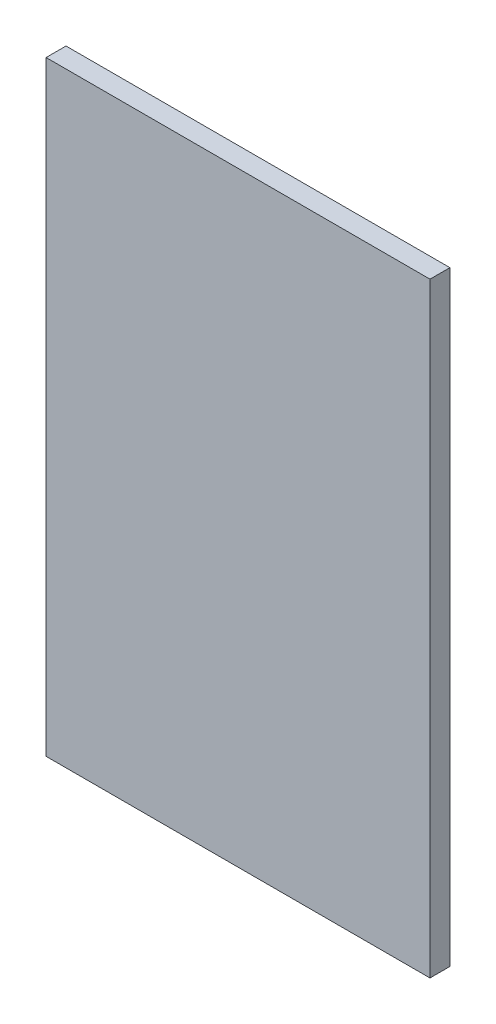
ISO-10303-21;
HEADER;
FILE_DESCRIPTION(('STEP AP214'),'2;1');
FILE_NAME('part.step','',(''),(''),'','','');
FILE_SCHEMA(('AUTOMOTIVE_DESIGN { 1 0 10303 214 1 1 1 1 }'));
ENDSEC;
DATA;
#1=APPLICATION_CONTEXT('core data for automotive mechanical design processes');
#2=APPLICATION_PROTOCOL_DEFINITION('international standard','automotive_design',2000,#1);
#3=PRODUCT_CONTEXT('',#1,'mechanical');
#4=PRODUCT('Part','Part','',(#3));
#5=PRODUCT_RELATED_PRODUCT_CATEGORY('part','',(#4));
#6=PRODUCT_DEFINITION_FORMATION('','',#4);
#7=PRODUCT_DEFINITION_CONTEXT('part definition',#1,'design');
#8=PRODUCT_DEFINITION('design','',#6,#7);
#9=PRODUCT_DEFINITION_SHAPE('','',#8);
#10=(LENGTH_UNIT() NAMED_UNIT(*) SI_UNIT(.MILLI.,.METRE.));
#11=(NAMED_UNIT(*) PLANE_ANGLE_UNIT() SI_UNIT($,.RADIAN.));
#12=(NAMED_UNIT(*) SI_UNIT($,.STERADIAN.) SOLID_ANGLE_UNIT());
#13=UNCERTAINTY_MEASURE_WITH_UNIT(LENGTH_MEASURE(1.E-05),#10,'distance_accuracy_value','');
#14=(GEOMETRIC_REPRESENTATION_CONTEXT(3) GLOBAL_UNCERTAINTY_ASSIGNED_CONTEXT((#13)) GLOBAL_UNIT_ASSIGNED_CONTEXT((#10,
#11,#12)) REPRESENTATION_CONTEXT('',''));
#15=CARTESIAN_POINT('',(0.,0.,0.));
#16=DIRECTION('',(0.,0.,1.));
#17=DIRECTION('',(1.,0.,0.));
#18=AXIS2_PLACEMENT_3D('',#15,#16,#17);
#19=CARTESIAN_POINT('',(0.,0.,18.));
#20=DIRECTION('',(1.,0.,0.));
#21=DIRECTION('',(0.,0.,-1.));
#22=AXIS2_PLACEMENT_3D('',#19,#20,#21);
#23=PLANE('',#22);
#24=DIRECTION('',(0.,-1.,0.));
#25=VECTOR('',#24,1.);
#26=CARTESIAN_POINT('',(0.,0.,0.));
#27=LINE('',#26,#25);
#28=CARTESIAN_POINT('',(0.,546.608,0.));
#29=VERTEX_POINT('',#28);
#30=CARTESIAN_POINT('',(0.,0.,0.));
#31=VERTEX_POINT('',#30);
#32=EDGE_CURVE('E96',#29,#31,#27,.T.);
#33=ORIENTED_EDGE('',*,*,#32,.T.);
#34=DIRECTION('',(0.,0.,-1.));
#35=VECTOR('',#34,1.);
#36=CARTESIAN_POINT('',(0.,0.,18.));
#37=LINE('',#36,#35);
#38=CARTESIAN_POINT('',(0.,0.,18.));
#39=VERTEX_POINT('',#38);
#40=EDGE_CURVE('E11',#39,#31,#37,.T.);
#41=ORIENTED_EDGE('',*,*,#40,.F.);
#42=DIRECTION('',(0.,-1.,0.));
#43=VECTOR('',#42,1.);
#44=CARTESIAN_POINT('',(0.,0.,18.));
#45=LINE('',#44,#43);
#46=CARTESIAN_POINT('',(0.,546.608,18.));
#47=VERTEX_POINT('',#46);
#48=EDGE_CURVE('E84',#47,#39,#45,.T.);
#49=ORIENTED_EDGE('',*,*,#48,.F.);
#50=DIRECTION('',(0.,0.,-1.));
#51=VECTOR('',#50,1.);
#52=CARTESIAN_POINT('',(0.,546.608,18.));
#53=LINE('',#52,#51);
#54=EDGE_CURVE('E92',#47,#29,#53,.T.);
#55=ORIENTED_EDGE('',*,*,#54,.T.);
#56=EDGE_LOOP('',(#33,#41,#49,#55));
#57=FACE_BOUND('',#56,.T.);
#58=ADVANCED_FACE('F33',(#57),#23,.F.);
#59=CARTESIAN_POINT('',(0.,0.,18.));
#60=DIRECTION('',(0.,1.,0.));
#61=DIRECTION('',(0.,0.,1.));
#62=AXIS2_PLACEMENT_3D('',#59,#60,#61);
#63=PLANE('',#62);
#64=DIRECTION('',(1.,0.,0.));
#65=VECTOR('',#64,1.);
#66=CARTESIAN_POINT('',(0.,0.,0.));
#67=LINE('',#66,#65);
#68=CARTESIAN_POINT('',(346.71,0.,0.));
#69=VERTEX_POINT('',#68);
#70=EDGE_CURVE('E88',#31,#69,#67,.T.);
#71=ORIENTED_EDGE('',*,*,#70,.T.);
#72=DIRECTION('',(0.,0.,-1.));
#73=VECTOR('',#72,1.);
#74=CARTESIAN_POINT('',(346.71,0.,18.));
#75=LINE('',#74,#73);
#76=CARTESIAN_POINT('',(346.71,0.,18.));
#77=VERTEX_POINT('',#76);
#78=EDGE_CURVE('E41',#77,#69,#75,.T.);
#79=ORIENTED_EDGE('',*,*,#78,.F.);
#80=DIRECTION('',(1.,0.,0.));
#81=VECTOR('',#80,1.);
#82=CARTESIAN_POINT('',(0.,0.,18.));
#83=LINE('',#82,#81);
#84=EDGE_CURVE('E79',#39,#77,#83,.T.);
#85=ORIENTED_EDGE('',*,*,#84,.F.);
#86=ORIENTED_EDGE('',*,*,#40,.T.);
#87=EDGE_LOOP('',(#71,#79,#85,#86));
#88=FACE_BOUND('',#87,.T.);
#89=ADVANCED_FACE('F87',(#88),#63,.F.);
#90=CARTESIAN_POINT('',(346.71,0.,18.));
#91=DIRECTION('',(-1.,0.,0.));
#92=DIRECTION('',(0.,0.,1.));
#93=AXIS2_PLACEMENT_3D('',#90,#91,#92);
#94=PLANE('',#93);
#95=DIRECTION('',(0.,1.,0.));
#96=VECTOR('',#95,1.);
#97=CARTESIAN_POINT('',(346.71,0.,0.));
#98=LINE('',#97,#96);
#99=CARTESIAN_POINT('',(346.71,546.608,0.));
#100=VERTEX_POINT('',#99);
#101=EDGE_CURVE('E66',#69,#100,#98,.T.);
#102=ORIENTED_EDGE('',*,*,#101,.T.);
#103=DIRECTION('',(0.,0.,-1.));
#104=VECTOR('',#103,1.);
#105=CARTESIAN_POINT('',(346.71,546.608,18.));
#106=LINE('',#105,#104);
#107=CARTESIAN_POINT('',(346.71,546.608,18.));
#108=VERTEX_POINT('',#107);
#109=EDGE_CURVE('E89',#108,#100,#106,.T.);
#110=ORIENTED_EDGE('',*,*,#109,.F.);
#111=DIRECTION('',(0.,1.,0.));
#112=VECTOR('',#111,1.);
#113=CARTESIAN_POINT('',(346.71,0.,18.));
#114=LINE('',#113,#112);
#115=EDGE_CURVE('E82',#77,#108,#114,.T.);
#116=ORIENTED_EDGE('',*,*,#115,.F.);
#117=ORIENTED_EDGE('',*,*,#78,.T.);
#118=EDGE_LOOP('',(#102,#110,#116,#117));
#119=FACE_BOUND('',#118,.T.);
#120=ADVANCED_FACE('F90',(#119),#94,.F.);
#121=CARTESIAN_POINT('',(0.,546.608,18.));
#122=DIRECTION('',(0.,-1.,0.));
#123=DIRECTION('',(0.,0.,-1.));
#124=AXIS2_PLACEMENT_3D('',#121,#122,#123);
#125=PLANE('',#124);
#126=DIRECTION('',(-1.,0.,0.));
#127=VECTOR('',#126,1.);
#128=CARTESIAN_POINT('',(0.,546.608,0.));
#129=LINE('',#128,#127);
#130=EDGE_CURVE('E72',#100,#29,#129,.T.);
#131=ORIENTED_EDGE('',*,*,#130,.T.);
#132=ORIENTED_EDGE('',*,*,#54,.F.);
#133=DIRECTION('',(-1.,0.,0.));
#134=VECTOR('',#133,1.);
#135=CARTESIAN_POINT('',(0.,546.608,18.));
#136=LINE('',#135,#134);
#137=EDGE_CURVE('E49',#108,#47,#136,.T.);
#138=ORIENTED_EDGE('',*,*,#137,.F.);
#139=ORIENTED_EDGE('',*,*,#109,.T.);
#140=EDGE_LOOP('',(#131,#132,#138,#139));
#141=FACE_BOUND('',#140,.T.);
#142=ADVANCED_FACE('F103',(#141),#125,.F.);
#143=CARTESIAN_POINT('',(0.,0.,18.));
#144=DIRECTION('',(0.,0.,-1.));
#145=DIRECTION('',(-1.,0.,0.));
#146=AXIS2_PLACEMENT_3D('',#143,#144,#145);
#147=PLANE('',#146);
#148=ORIENTED_EDGE('',*,*,#48,.T.);
#149=ORIENTED_EDGE('',*,*,#84,.T.);
#150=ORIENTED_EDGE('',*,*,#115,.T.);
#151=ORIENTED_EDGE('',*,*,#137,.T.);
#152=EDGE_LOOP('',(#148,#149,#150,#151));
#153=FACE_BOUND('',#152,.T.);
#154=ADVANCED_FACE('F80',(#153),#147,.F.);
#155=CARTESIAN_POINT('',(0.,0.,0.));
#156=DIRECTION('',(0.,0.,-1.));
#157=DIRECTION('',(-1.,0.,0.));
#158=AXIS2_PLACEMENT_3D('',#155,#156,#157);
#159=PLANE('',#158);
#160=ORIENTED_EDGE('',*,*,#32,.F.);
#161=ORIENTED_EDGE('',*,*,#130,.F.);
#162=ORIENTED_EDGE('',*,*,#101,.F.);
#163=ORIENTED_EDGE('',*,*,#70,.F.);
#164=EDGE_LOOP('',(#160,#161,#162,#163));
#165=FACE_BOUND('',#164,.T.);
#166=ADVANCED_FACE('F106',(#165),#159,.T.);
#167=CLOSED_SHELL('',(#58,#89,#120,#142,#154,#166));
#168=MANIFOLD_SOLID_BREP('B2',#167);
#169=ADVANCED_BREP_SHAPE_REPRESENTATION('',(#18,#168),#14);
#170=SHAPE_DEFINITION_REPRESENTATION(#9,#169);
ENDSEC;
END-ISO-10303-21;
